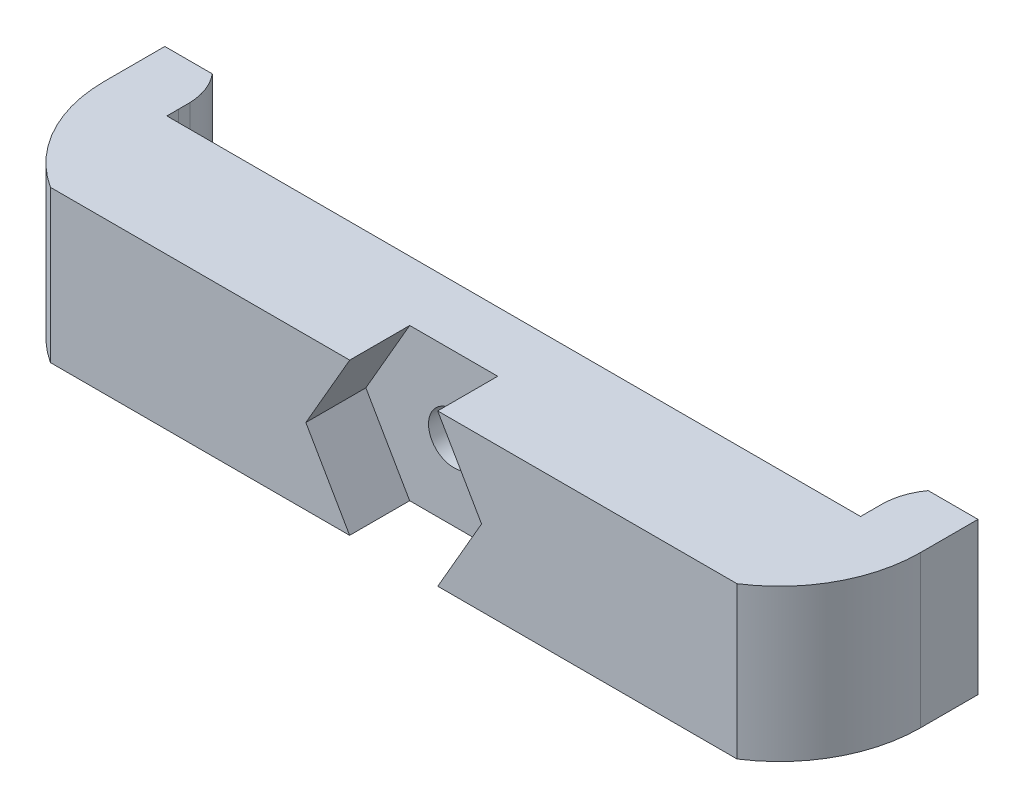
ISO-10303-21;
HEADER;
FILE_DESCRIPTION(('STEP AP214'),'2;1');
FILE_NAME('part.step','',(''),(''),'','','');
FILE_SCHEMA(('AUTOMOTIVE_DESIGN { 1 0 10303 214 1 1 1 1 }'));
ENDSEC;
DATA;
#1=APPLICATION_CONTEXT('core data for automotive mechanical design processes');
#2=APPLICATION_PROTOCOL_DEFINITION('international standard','automotive_design',2000,#1);
#3=PRODUCT_CONTEXT('',#1,'mechanical');
#4=PRODUCT('Part','Part','',(#3));
#5=PRODUCT_RELATED_PRODUCT_CATEGORY('part','',(#4));
#6=PRODUCT_DEFINITION_FORMATION('','',#4);
#7=PRODUCT_DEFINITION_CONTEXT('part definition',#1,'design');
#8=PRODUCT_DEFINITION('design','',#6,#7);
#9=PRODUCT_DEFINITION_SHAPE('','',#8);
#10=(LENGTH_UNIT() NAMED_UNIT(*) SI_UNIT(.MILLI.,.METRE.));
#11=(NAMED_UNIT(*) PLANE_ANGLE_UNIT() SI_UNIT($,.RADIAN.));
#12=(NAMED_UNIT(*) SI_UNIT($,.STERADIAN.) SOLID_ANGLE_UNIT());
#13=UNCERTAINTY_MEASURE_WITH_UNIT(LENGTH_MEASURE(1.E-05),#10,'distance_accuracy_value','');
#14=(GEOMETRIC_REPRESENTATION_CONTEXT(3) GLOBAL_UNCERTAINTY_ASSIGNED_CONTEXT((#13)) GLOBAL_UNIT_ASSIGNED_CONTEXT((#10,
#11,#12)) REPRESENTATION_CONTEXT('',''));
#15=CARTESIAN_POINT('',(0.,0.,0.));
#16=DIRECTION('',(0.,0.,1.));
#17=DIRECTION('',(1.,0.,0.));
#18=AXIS2_PLACEMENT_3D('',#15,#16,#17);
#19=CARTESIAN_POINT('',(33.9,12.65,-11.7503239912908));
#20=DIRECTION('',(0.,1.,0.));
#21=DIRECTION('',(0.,0.,1.));
#22=AXIS2_PLACEMENT_3D('',#19,#20,#21);
#23=CYLINDRICAL_SURFACE('',#22,5.);
#24=DIRECTION('',(0.,1.,0.));
#25=VECTOR('',#24,1.);
#26=CARTESIAN_POINT('',(29.8508515633177,12.65,-14.6836492268747));
#27=LINE('',#26,#25);
#28=CARTESIAN_POINT('',(29.8508515633177,0.,-14.6836492268747));
#29=VERTEX_POINT('',#28);
#30=CARTESIAN_POINT('',(29.8508515633177,12.65,-14.6836492268747));
#31=VERTEX_POINT('',#30);
#32=EDGE_CURVE('E214',#29,#31,#27,.T.);
#33=ORIENTED_EDGE('',*,*,#32,.F.);
#34=CARTESIAN_POINT('',(33.9,0.,-11.7503239912908));
#35=DIRECTION('',(0.,-1.,0.));
#36=DIRECTION('',(0.,0.,-1.));
#37=AXIS2_PLACEMENT_3D('',#34,#35,#36);
#38=CIRCLE('',#37,5.);
#39=CARTESIAN_POINT('',(28.9033546437585,0.,-11.9334501334711));
#40=VERTEX_POINT('',#39);
#41=EDGE_CURVE('E353',#40,#29,#38,.T.);
#42=ORIENTED_EDGE('',*,*,#41,.F.);
#43=DIRECTION('',(0.,1.,0.));
#44=VECTOR('',#43,1.);
#45=CARTESIAN_POINT('',(28.9033546437585,12.65,-11.9334501334711));
#46=LINE('',#45,#44);
#47=CARTESIAN_POINT('',(28.9033546437585,12.65,-11.9334501334711));
#48=VERTEX_POINT('',#47);
#49=EDGE_CURVE('E58',#48,#40,#46,.F.);
#50=ORIENTED_EDGE('',*,*,#49,.F.);
#51=CARTESIAN_POINT('',(33.9,12.65,-11.7503239912908));
#52=DIRECTION('',(0.,-1.,0.));
#53=DIRECTION('',(0.,0.,-1.));
#54=AXIS2_PLACEMENT_3D('',#51,#52,#53);
#55=CIRCLE('',#54,5.);
#56=EDGE_CURVE('E355',#31,#48,#55,.F.);
#57=ORIENTED_EDGE('',*,*,#56,.F.);
#58=EDGE_LOOP('',(#33,#42,#50,#57));
#59=FACE_BOUND('',#58,.T.);
#60=ADVANCED_FACE('F37',(#59),#23,.T.);
#61=CARTESIAN_POINT('',(-33.9,12.65,-11.7503239912908));
#62=DIRECTION('',(0.,-1.,0.));
#63=DIRECTION('',(0.,0.,-1.));
#64=AXIS2_PLACEMENT_3D('',#61,#62,#63);
#65=CYLINDRICAL_SURFACE('',#64,5.);
#66=DIRECTION('',(0.,-1.,0.));
#67=VECTOR('',#66,1.);
#68=CARTESIAN_POINT('',(-28.9033546437585,12.65,-11.9334501334709));
#69=LINE('',#68,#67);
#70=CARTESIAN_POINT('',(-28.9033546437585,0.,-11.9334501334709));
#71=VERTEX_POINT('',#70);
#72=CARTESIAN_POINT('',(-28.9033546437585,12.65,-11.9334501334709));
#73=VERTEX_POINT('',#72);
#74=EDGE_CURVE('E237',#71,#73,#69,.F.);
#75=ORIENTED_EDGE('',*,*,#74,.F.);
#76=CARTESIAN_POINT('',(-33.9,0.,-11.7503239912908));
#77=DIRECTION('',(0.,-1.,0.));
#78=DIRECTION('',(0.,0.,-1.));
#79=AXIS2_PLACEMENT_3D('',#76,#77,#78);
#80=CIRCLE('',#79,5.);
#81=CARTESIAN_POINT('',(-30.0417402182721,0.,-14.9305490551347));
#82=VERTEX_POINT('',#81);
#83=EDGE_CURVE('E350',#82,#71,#80,.T.);
#84=ORIENTED_EDGE('',*,*,#83,.F.);
#85=DIRECTION('',(0.,-1.,0.));
#86=VECTOR('',#85,1.);
#87=CARTESIAN_POINT('',(-30.0417402182721,12.65,-14.9305490551347));
#88=LINE('',#87,#86);
#89=CARTESIAN_POINT('',(-30.0417402182721,12.65,-14.9305490551347));
#90=VERTEX_POINT('',#89);
#91=EDGE_CURVE('E226',#90,#82,#88,.T.);
#92=ORIENTED_EDGE('',*,*,#91,.F.);
#93=CARTESIAN_POINT('',(-33.9,12.65,-11.7503239912908));
#94=DIRECTION('',(0.,-1.,0.));
#95=DIRECTION('',(0.,0.,-1.));
#96=AXIS2_PLACEMENT_3D('',#93,#94,#95);
#97=CIRCLE('',#96,5.);
#98=EDGE_CURVE('E345',#73,#90,#97,.F.);
#99=ORIENTED_EDGE('',*,*,#98,.F.);
#100=EDGE_LOOP('',(#75,#84,#92,#99));
#101=FACE_BOUND('',#100,.T.);
#102=ADVANCED_FACE('F374',(#101),#65,.T.);
#103=CARTESIAN_POINT('',(-28.6,12.65,0.));
#104=DIRECTION('',(0.,0.,-1.));
#105=DIRECTION('',(-1.,0.,0.));
#106=AXIS2_PLACEMENT_3D('',#103,#104,#105);
#107=PLANE('',#106);
#108=DIRECTION('',(1.,0.,0.));
#109=VECTOR('',#108,1.);
#110=CARTESIAN_POINT('',(-28.6,12.65,0.));
#111=LINE('',#110,#109);
#112=CARTESIAN_POINT('',(3.66537279602967,12.65,0.));
#113=VERTEX_POINT('',#112);
#114=CARTESIAN_POINT('',(28.6,12.65,0.));
#115=VERTEX_POINT('',#114);
#116=EDGE_CURVE('E280',#113,#115,#111,.T.);
#117=ORIENTED_EDGE('',*,*,#116,.F.);
#118=DIRECTION('',(-0.499999999999999,0.866025403784439,0.));
#119=VECTOR('',#118,1.);
#120=CARTESIAN_POINT('',(7.31999999999999,6.32,0.));
#121=LINE('',#120,#119);
#122=CARTESIAN_POINT('',(7.31999999999999,6.32,0.));
#123=VERTEX_POINT('',#122);
#124=EDGE_CURVE('E246',#123,#113,#121,.T.);
#125=ORIENTED_EDGE('',*,*,#124,.F.);
#126=DIRECTION('',(0.5,0.866025403784438,0.));
#127=VECTOR('',#126,1.);
#128=CARTESIAN_POINT('',(3.65999999999999,-0.0193059557020838,0.));
#129=LINE('',#128,#127);
#130=CARTESIAN_POINT('',(3.67114629872155,0.,0.));
#131=VERTEX_POINT('',#130);
#132=EDGE_CURVE('E254',#131,#123,#129,.T.);
#133=ORIENTED_EDGE('',*,*,#132,.F.);
#134=DIRECTION('',(1.,0.,0.));
#135=VECTOR('',#134,1.);
#136=CARTESIAN_POINT('',(-28.6,0.,0.));
#137=LINE('',#136,#135);
#138=CARTESIAN_POINT('',(28.6,0.,0.));
#139=VERTEX_POINT('',#138);
#140=EDGE_CURVE('E300',#131,#139,#137,.T.);
#141=ORIENTED_EDGE('',*,*,#140,.T.);
#142=DIRECTION('',(0.,-1.,0.));
#143=VECTOR('',#142,1.);
#144=CARTESIAN_POINT('',(28.6,12.65,0.));
#145=LINE('',#144,#143);
#146=EDGE_CURVE('E322',#115,#139,#145,.T.);
#147=ORIENTED_EDGE('',*,*,#146,.F.);
#148=EDGE_LOOP('',(#117,#125,#133,#141,#147));
#149=FACE_BOUND('',#148,.T.);
#150=ADVANCED_FACE('F408',(#149),#107,.F.);
#151=CARTESIAN_POINT('',(-34.,12.65,-17.2661332877055));
#152=DIRECTION('',(1.,0.,0.));
#153=DIRECTION('',(0.,0.,-1.));
#154=AXIS2_PLACEMENT_3D('',#151,#152,#153);
#155=PLANE('',#154);
#156=DIRECTION('',(0.,0.,1.));
#157=VECTOR('',#156,1.);
#158=CARTESIAN_POINT('',(-34.,12.65,-17.2661332877055));
#159=LINE('',#158,#157);
#160=CARTESIAN_POINT('',(-34.,12.65,-14.9305490551347));
#161=VERTEX_POINT('',#160);
#162=CARTESIAN_POINT('',(-34.,12.65,-9.89204316547453));
#163=VERTEX_POINT('',#162);
#164=EDGE_CURVE('E275',#161,#163,#159,.T.);
#165=ORIENTED_EDGE('',*,*,#164,.F.);
#166=DIRECTION('',(0.,-1.,0.));
#167=VECTOR('',#166,1.);
#168=CARTESIAN_POINT('',(-34.,12.65,-14.9305490551347));
#169=LINE('',#168,#167);
#170=CARTESIAN_POINT('',(-34.,0.,-14.9305490551347));
#171=VERTEX_POINT('',#170);
#172=EDGE_CURVE('E223',#161,#171,#169,.T.);
#173=ORIENTED_EDGE('',*,*,#172,.T.);
#174=DIRECTION('',(0.,0.,1.));
#175=VECTOR('',#174,1.);
#176=CARTESIAN_POINT('',(-34.,0.,-17.2661332877055));
#177=LINE('',#176,#175);
#178=CARTESIAN_POINT('',(-34.,0.,-9.89204316547453));
#179=VERTEX_POINT('',#178);
#180=EDGE_CURVE('E274',#171,#179,#177,.T.);
#181=ORIENTED_EDGE('',*,*,#180,.T.);
#182=DIRECTION('',(0.,-1.,0.));
#183=VECTOR('',#182,1.);
#184=CARTESIAN_POINT('',(-34.,12.65,-9.89204316547453));
#185=LINE('',#184,#183);
#186=EDGE_CURVE('E328',#163,#179,#185,.T.);
#187=ORIENTED_EDGE('',*,*,#186,.F.);
#188=EDGE_LOOP('',(#165,#173,#181,#187));
#189=FACE_BOUND('',#188,.T.);
#190=ADVANCED_FACE('F442',(#189),#155,.F.);
#191=CARTESIAN_POINT('',(-22.2395816678133,12.65,-9.8920431654748));
#192=DIRECTION('',(0.,-1.,0.));
#193=DIRECTION('',(0.,0.,-1.));
#194=AXIS2_PLACEMENT_3D('',#191,#192,#193);
#195=CYLINDRICAL_SURFACE('',#194,11.7604183321867);
#196=CARTESIAN_POINT('',(-22.2395816678133,0.,-9.8920431654748));
#197=DIRECTION('',(0.,1.,0.));
#198=DIRECTION('',(0.,0.,1.));
#199=AXIS2_PLACEMENT_3D('',#196,#197,#198);
#200=CIRCLE('',#199,11.7604183321867);
#201=CARTESIAN_POINT('',(-28.6,0.,0.));
#202=VERTEX_POINT('',#201);
#203=EDGE_CURVE('E298',#179,#202,#200,.T.);
#204=ORIENTED_EDGE('',*,*,#203,.T.);
#205=DIRECTION('',(0.,-1.,0.));
#206=VECTOR('',#205,1.);
#207=CARTESIAN_POINT('',(-28.6,12.65,0.));
#208=LINE('',#207,#206);
#209=CARTESIAN_POINT('',(-28.6,12.65,0.));
#210=VERTEX_POINT('',#209);
#211=EDGE_CURVE('E325',#210,#202,#208,.T.);
#212=ORIENTED_EDGE('',*,*,#211,.F.);
#213=CARTESIAN_POINT('',(-22.2395816678133,12.65,-9.8920431654748));
#214=DIRECTION('',(0.,1.,0.));
#215=DIRECTION('',(0.,0.,1.));
#216=AXIS2_PLACEMENT_3D('',#213,#214,#215);
#217=CIRCLE('',#216,11.7604183321867);
#218=EDGE_CURVE('E277',#163,#210,#217,.T.);
#219=ORIENTED_EDGE('',*,*,#218,.F.);
#220=ORIENTED_EDGE('',*,*,#186,.T.);
#221=EDGE_LOOP('',(#204,#212,#219,#220));
#222=FACE_BOUND('',#221,.T.);
#223=ADVANCED_FACE('F438',(#222),#195,.T.);
#224=CARTESIAN_POINT('',(-3.67114629872155,0.,0.));
#225=VERTEX_POINT('',#224);
#226=EDGE_CURVE('E301',#202,#225,#137,.T.);
#227=ORIENTED_EDGE('',*,*,#226,.T.);
#228=DIRECTION('',(0.5,-0.866025403784439,0.));
#229=VECTOR('',#228,1.);
#230=CARTESIAN_POINT('',(-7.31999999999999,6.32,0.));
#231=LINE('',#230,#229);
#232=CARTESIAN_POINT('',(-7.31999999999999,6.32,0.));
#233=VERTEX_POINT('',#232);
#234=EDGE_CURVE('E264',#233,#225,#231,.T.);
#235=ORIENTED_EDGE('',*,*,#234,.F.);
#236=DIRECTION('',(-0.5,-0.866025403784439,0.));
#237=VECTOR('',#236,1.);
#238=CARTESIAN_POINT('',(-3.65999999999999,12.6593059557021,0.));
#239=LINE('',#238,#237);
#240=CARTESIAN_POINT('',(-3.66537279602966,12.65,0.));
#241=VERTEX_POINT('',#240);
#242=EDGE_CURVE('E262',#241,#233,#239,.T.);
#243=ORIENTED_EDGE('',*,*,#242,.F.);
#244=EDGE_CURVE('E281',#210,#241,#111,.T.);
#245=ORIENTED_EDGE('',*,*,#244,.F.);
#246=ORIENTED_EDGE('',*,*,#211,.T.);
#247=EDGE_LOOP('',(#227,#235,#243,#245,#246));
#248=FACE_BOUND('',#247,.T.);
#249=ADVANCED_FACE('F428',(#248),#107,.F.);
#250=CARTESIAN_POINT('',(22.2395816678138,12.65,-9.89204316547453));
#251=DIRECTION('',(0.,-1.,0.));
#252=DIRECTION('',(0.,0.,-1.));
#253=AXIS2_PLACEMENT_3D('',#250,#251,#252);
#254=CYLINDRICAL_SURFACE('',#253,11.7604183321862);
#255=CARTESIAN_POINT('',(22.2395816678138,0.,-9.89204316547453));
#256=DIRECTION('',(0.,1.,0.));
#257=DIRECTION('',(0.,0.,-1.));
#258=AXIS2_PLACEMENT_3D('',#255,#256,#257);
#259=CIRCLE('',#258,11.7604183321862);
#260=CARTESIAN_POINT('',(34.,0.,-9.89204316547453));
#261=VERTEX_POINT('',#260);
#262=EDGE_CURVE('E304',#139,#261,#259,.T.);
#263=ORIENTED_EDGE('',*,*,#262,.T.);
#264=DIRECTION('',(0.,-1.,0.));
#265=VECTOR('',#264,1.);
#266=CARTESIAN_POINT('',(34.,12.65,-9.89204316547453));
#267=LINE('',#266,#265);
#268=CARTESIAN_POINT('',(34.,12.65,-9.89204316547453));
#269=VERTEX_POINT('',#268);
#270=EDGE_CURVE('E319',#269,#261,#267,.T.);
#271=ORIENTED_EDGE('',*,*,#270,.F.);
#272=CARTESIAN_POINT('',(22.2395816678138,12.65,-9.89204316547453));
#273=DIRECTION('',(0.,1.,0.));
#274=DIRECTION('',(0.,0.,-1.));
#275=AXIS2_PLACEMENT_3D('',#272,#273,#274);
#276=CIRCLE('',#275,11.7604183321862);
#277=EDGE_CURVE('E284',#115,#269,#276,.T.);
#278=ORIENTED_EDGE('',*,*,#277,.F.);
#279=ORIENTED_EDGE('',*,*,#146,.T.);
#280=EDGE_LOOP('',(#263,#271,#278,#279));
#281=FACE_BOUND('',#280,.T.);
#282=ADVANCED_FACE('F401',(#281),#254,.T.);
#283=CARTESIAN_POINT('',(34.,12.65,-17.2661332877055));
#284=DIRECTION('',(-1.,0.,0.));
#285=DIRECTION('',(0.,0.,1.));
#286=AXIS2_PLACEMENT_3D('',#283,#284,#285);
#287=PLANE('',#286);
#288=DIRECTION('',(0.,0.,-1.));
#289=VECTOR('',#288,1.);
#290=CARTESIAN_POINT('',(34.,0.,-17.2661332877055));
#291=LINE('',#290,#289);
#292=CARTESIAN_POINT('',(34.,0.,-14.6836492268747));
#293=VERTEX_POINT('',#292);
#294=EDGE_CURVE('E306',#261,#293,#291,.T.);
#295=ORIENTED_EDGE('',*,*,#294,.T.);
#296=DIRECTION('',(0.,1.,0.));
#297=VECTOR('',#296,1.);
#298=CARTESIAN_POINT('',(34.,12.65,-14.6836492268747));
#299=LINE('',#298,#297);
#300=CARTESIAN_POINT('',(34.,12.65,-14.6836492268747));
#301=VERTEX_POINT('',#300);
#302=EDGE_CURVE('E50',#293,#301,#299,.T.);
#303=ORIENTED_EDGE('',*,*,#302,.T.);
#304=DIRECTION('',(0.,0.,-1.));
#305=VECTOR('',#304,1.);
#306=CARTESIAN_POINT('',(34.,12.65,-17.2661332877055));
#307=LINE('',#306,#305);
#308=EDGE_CURVE('E286',#269,#301,#307,.T.);
#309=ORIENTED_EDGE('',*,*,#308,.F.);
#310=ORIENTED_EDGE('',*,*,#270,.T.);
#311=EDGE_LOOP('',(#295,#303,#309,#310));
#312=FACE_BOUND('',#311,.T.);
#313=ADVANCED_FACE('F396',(#312),#287,.F.);
#314=CARTESIAN_POINT('',(28.9,12.65,-15.));
#315=DIRECTION('',(1.,0.,0.));
#316=DIRECTION('',(0.,0.,-1.));
#317=AXIS2_PLACEMENT_3D('',#314,#315,#316);
#318=PLANE('',#317);
#319=DIRECTION('',(0.,0.,1.));
#320=VECTOR('',#319,1.);
#321=CARTESIAN_POINT('',(28.9,12.65,-15.));
#322=LINE('',#321,#320);
#323=CARTESIAN_POINT('',(28.9,12.65,-10.9506275499279));
#324=VERTEX_POINT('',#323);
#325=CARTESIAN_POINT('',(28.9,12.65,-10.));
#326=VERTEX_POINT('',#325);
#327=EDGE_CURVE('E289',#324,#326,#322,.T.);
#328=ORIENTED_EDGE('',*,*,#327,.F.);
#329=DIRECTION('',(0.,-1.,0.));
#330=VECTOR('',#329,1.);
#331=CARTESIAN_POINT('',(28.9,12.65,-10.9506275499279));
#332=LINE('',#331,#330);
#333=CARTESIAN_POINT('',(28.9,0.,-10.9506275499279));
#334=VERTEX_POINT('',#333);
#335=EDGE_CURVE('E208',#324,#334,#332,.T.);
#336=ORIENTED_EDGE('',*,*,#335,.T.);
#337=DIRECTION('',(0.,0.,1.));
#338=VECTOR('',#337,1.);
#339=CARTESIAN_POINT('',(28.9,0.,-15.));
#340=LINE('',#339,#338);
#341=CARTESIAN_POINT('',(28.9,0.,-10.));
#342=VERTEX_POINT('',#341);
#343=EDGE_CURVE('E202',#334,#342,#340,.T.);
#344=ORIENTED_EDGE('',*,*,#343,.T.);
#345=DIRECTION('',(0.,-1.,0.));
#346=VECTOR('',#345,1.);
#347=CARTESIAN_POINT('',(28.9,12.65,-10.));
#348=LINE('',#347,#346);
#349=EDGE_CURVE('E316',#326,#342,#348,.T.);
#350=ORIENTED_EDGE('',*,*,#349,.F.);
#351=EDGE_LOOP('',(#328,#336,#344,#350));
#352=FACE_BOUND('',#351,.T.);
#353=ADVANCED_FACE('F389',(#352),#318,.F.);
#354=CARTESIAN_POINT('',(28.9,12.65,-10.));
#355=DIRECTION('',(0.,0.,1.));
#356=DIRECTION('',(1.,0.,0.));
#357=AXIS2_PLACEMENT_3D('',#354,#355,#356);
#358=PLANE('',#357);
#359=CARTESIAN_POINT('',(0.,6.32,-10.));
#360=DIRECTION('',(0.,0.,-1.));
#361=DIRECTION('',(-1.,0.,0.));
#362=AXIS2_PLACEMENT_3D('',#359,#360,#361);
#363=CIRCLE('',#362,4.75);
#364=CARTESIAN_POINT('',(-4.75,6.32,-10.));
#365=VERTEX_POINT('',#364);
#366=EDGE_CURVE('E247',#365,#365,#363,.T.);
#367=ORIENTED_EDGE('',*,*,#366,.F.);
#368=EDGE_LOOP('',(#367));
#369=FACE_BOUND('',#368,.T.);
#370=DIRECTION('',(-1.,0.,0.));
#371=VECTOR('',#370,1.);
#372=CARTESIAN_POINT('',(28.9,0.,-10.));
#373=LINE('',#372,#371);
#374=CARTESIAN_POINT('',(-28.9,0.,-10.));
#375=VERTEX_POINT('',#374);
#376=EDGE_CURVE('E310',#342,#375,#373,.T.);
#377=ORIENTED_EDGE('',*,*,#376,.T.);
#378=DIRECTION('',(0.,-1.,0.));
#379=VECTOR('',#378,1.);
#380=CARTESIAN_POINT('',(-28.9,12.65,-10.));
#381=LINE('',#380,#379);
#382=CARTESIAN_POINT('',(-28.9,12.65,-10.));
#383=VERTEX_POINT('',#382);
#384=EDGE_CURVE('E296',#383,#375,#381,.T.);
#385=ORIENTED_EDGE('',*,*,#384,.F.);
#386=DIRECTION('',(-1.,0.,0.));
#387=VECTOR('',#386,1.);
#388=CARTESIAN_POINT('',(28.9,12.65,-10.));
#389=LINE('',#388,#387);
#390=EDGE_CURVE('E291',#326,#383,#389,.T.);
#391=ORIENTED_EDGE('',*,*,#390,.F.);
#392=ORIENTED_EDGE('',*,*,#349,.T.);
#393=EDGE_LOOP('',(#377,#385,#391,#392));
#394=FACE_BOUND('',#393,.T.);
#395=ADVANCED_FACE('F384',(#369,#394),#358,.F.);
#396=CARTESIAN_POINT('',(-28.9,12.65,-15.));
#397=DIRECTION('',(-1.,0.,0.));
#398=DIRECTION('',(0.,0.,1.));
#399=AXIS2_PLACEMENT_3D('',#396,#397,#398);
#400=PLANE('',#399);
#401=DIRECTION('',(0.,0.,-1.));
#402=VECTOR('',#401,1.);
#403=CARTESIAN_POINT('',(-28.9,0.,-15.));
#404=LINE('',#403,#402);
#405=CARTESIAN_POINT('',(-28.9,0.,-10.9534597171963));
#406=VERTEX_POINT('',#405);
#407=EDGE_CURVE('E278',#375,#406,#404,.T.);
#408=ORIENTED_EDGE('',*,*,#407,.T.);
#409=DIRECTION('',(0.,1.,0.));
#410=VECTOR('',#409,1.);
#411=CARTESIAN_POINT('',(-28.9,12.65,-10.9534597171963));
#412=LINE('',#411,#410);
#413=CARTESIAN_POINT('',(-28.9,12.65,-10.9534597171963));
#414=VERTEX_POINT('',#413);
#415=EDGE_CURVE('E231',#406,#414,#412,.T.);
#416=ORIENTED_EDGE('',*,*,#415,.T.);
#417=DIRECTION('',(0.,0.,-1.));
#418=VECTOR('',#417,1.);
#419=CARTESIAN_POINT('',(-28.9,12.65,-15.));
#420=LINE('',#419,#418);
#421=EDGE_CURVE('E293',#383,#414,#420,.T.);
#422=ORIENTED_EDGE('',*,*,#421,.F.);
#423=ORIENTED_EDGE('',*,*,#384,.T.);
#424=EDGE_LOOP('',(#408,#416,#422,#423));
#425=FACE_BOUND('',#424,.T.);
#426=ADVANCED_FACE('F381',(#425),#400,.F.);
#427=CARTESIAN_POINT('',(22.2395816678138,12.65,-9.89204316547453));
#428=DIRECTION('',(0.,-1.,0.));
#429=DIRECTION('',(0.,0.,-1.));
#430=AXIS2_PLACEMENT_3D('',#427,#428,#429);
#431=PLANE('',#430);
#432=ORIENTED_EDGE('',*,*,#308,.T.);
#433=DIRECTION('',(-1.,0.,0.));
#434=VECTOR('',#433,1.);
#435=CARTESIAN_POINT('',(22.2395816678138,12.65,-14.6836492268747));
#436=LINE('',#435,#434);
#437=EDGE_CURVE('E210',#301,#31,#436,.T.);
#438=ORIENTED_EDGE('',*,*,#437,.T.);
#439=ORIENTED_EDGE('',*,*,#56,.T.);
#440=DIRECTION('',(0.,0.,1.));
#441=VECTOR('',#440,1.);
#442=CARTESIAN_POINT('',(28.9033546437585,12.65,-9.89204316547453));
#443=LINE('',#442,#441);
#444=CARTESIAN_POINT('',(28.9033546437585,12.65,-10.9422367085318));
#445=VERTEX_POINT('',#444);
#446=EDGE_CURVE('E192',#48,#445,#443,.T.);
#447=ORIENTED_EDGE('',*,*,#446,.T.);
#448=DIRECTION('',(-0.37122918158221,0.,-0.928541272503168));
#449=VECTOR('',#448,1.);
#450=CARTESIAN_POINT('',(28.347016136848,12.65,-12.3337848162193));
#451=LINE('',#450,#449);
#452=EDGE_CURVE('E190',#445,#324,#451,.T.);
#453=ORIENTED_EDGE('',*,*,#452,.T.);
#454=ORIENTED_EDGE('',*,*,#327,.T.);
#455=ORIENTED_EDGE('',*,*,#390,.T.);
#456=ORIENTED_EDGE('',*,*,#421,.T.);
#457=DIRECTION('',(-0.28638760967903,0.,0.958113843456158));
#458=VECTOR('',#457,1.);
#459=CARTESIAN_POINT('',(-24.9968849378332,12.65,-24.011386971296));
#460=LINE('',#459,#458);
#461=CARTESIAN_POINT('',(-28.9033546437585,12.65,-10.9422367085318));
#462=VERTEX_POINT('',#461);
#463=EDGE_CURVE('E228',#414,#462,#460,.T.);
#464=ORIENTED_EDGE('',*,*,#463,.T.);
#465=DIRECTION('',(0.,0.,-1.));
#466=VECTOR('',#465,1.);
#467=CARTESIAN_POINT('',(-28.9033546437585,12.65,-9.89204316547453));
#468=LINE('',#467,#466);
#469=EDGE_CURVE('E234',#462,#73,#468,.T.);
#470=ORIENTED_EDGE('',*,*,#469,.T.);
#471=ORIENTED_EDGE('',*,*,#98,.T.);
#472=DIRECTION('',(-1.,0.,0.));
#473=VECTOR('',#472,1.);
#474=CARTESIAN_POINT('',(22.2395816678138,12.65,-14.9305490551347));
#475=LINE('',#474,#473);
#476=EDGE_CURVE('E220',#90,#161,#475,.T.);
#477=ORIENTED_EDGE('',*,*,#476,.T.);
#478=ORIENTED_EDGE('',*,*,#164,.T.);
#479=ORIENTED_EDGE('',*,*,#218,.T.);
#480=ORIENTED_EDGE('',*,*,#244,.T.);
#481=DIRECTION('',(0.,0.,-1.));
#482=VECTOR('',#481,1.);
#483=CARTESIAN_POINT('',(-3.66537279602966,12.65,-9.89204316547453));
#484=LINE('',#483,#482);
#485=CARTESIAN_POINT('',(-3.66537279602966,12.65,-5.));
#486=VERTEX_POINT('',#485);
#487=EDGE_CURVE('E339',#241,#486,#484,.T.);
#488=ORIENTED_EDGE('',*,*,#487,.T.);
#489=DIRECTION('',(-1.,0.,0.));
#490=VECTOR('',#489,1.);
#491=CARTESIAN_POINT('',(22.2395816678138,12.65,-5.));
#492=LINE('',#491,#490);
#493=CARTESIAN_POINT('',(3.66537279602967,12.65,-5.));
#494=VERTEX_POINT('',#493);
#495=EDGE_CURVE('E270',#494,#486,#492,.T.);
#496=ORIENTED_EDGE('',*,*,#495,.F.);
#497=DIRECTION('',(0.,0.,1.));
#498=VECTOR('',#497,1.);
#499=CARTESIAN_POINT('',(3.66537279602967,12.65,-9.89204316547453));
#500=LINE('',#499,#498);
#501=EDGE_CURVE('E342',#494,#113,#500,.T.);
#502=ORIENTED_EDGE('',*,*,#501,.T.);
#503=ORIENTED_EDGE('',*,*,#116,.T.);
#504=ORIENTED_EDGE('',*,*,#277,.T.);
#505=EDGE_LOOP('',(#432,#438,#439,#447,#453,#454,#455,#456,#464,#470,#471,#477,#478,#479,#480,
#488,#496,#502,#503,#504));
#506=FACE_BOUND('',#505,.T.);
#507=ADVANCED_FACE('F377',(#506),#431,.F.);
#508=CARTESIAN_POINT('',(22.2395816678138,0.,-9.89204316547453));
#509=DIRECTION('',(0.,-1.,0.));
#510=DIRECTION('',(0.,0.,-1.));
#511=AXIS2_PLACEMENT_3D('',#508,#509,#510);
#512=PLANE('',#511);
#513=DIRECTION('',(-1.,0.,0.));
#514=VECTOR('',#513,1.);
#515=CARTESIAN_POINT('',(22.2395816678138,0.,-14.6836492268747));
#516=LINE('',#515,#514);
#517=EDGE_CURVE('E11',#293,#29,#516,.T.);
#518=ORIENTED_EDGE('',*,*,#517,.F.);
#519=ORIENTED_EDGE('',*,*,#294,.F.);
#520=ORIENTED_EDGE('',*,*,#262,.F.);
#521=ORIENTED_EDGE('',*,*,#140,.F.);
#522=DIRECTION('',(0.,0.,1.));
#523=VECTOR('',#522,1.);
#524=CARTESIAN_POINT('',(3.67114629872155,0.,-9.89204316547453));
#525=LINE('',#524,#523);
#526=CARTESIAN_POINT('',(3.67114629872155,0.,-5.));
#527=VERTEX_POINT('',#526);
#528=EDGE_CURVE('E337',#527,#131,#525,.T.);
#529=ORIENTED_EDGE('',*,*,#528,.F.);
#530=DIRECTION('',(-1.,0.,0.));
#531=VECTOR('',#530,1.);
#532=CARTESIAN_POINT('',(22.2395816678138,0.,-5.));
#533=LINE('',#532,#531);
#534=CARTESIAN_POINT('',(-3.67114629872155,0.,-5.));
#535=VERTEX_POINT('',#534);
#536=EDGE_CURVE('E331',#527,#535,#533,.T.);
#537=ORIENTED_EDGE('',*,*,#536,.T.);
#538=DIRECTION('',(0.,0.,-1.));
#539=VECTOR('',#538,1.);
#540=CARTESIAN_POINT('',(-3.67114629872155,0.,-9.89204316547453));
#541=LINE('',#540,#539);
#542=EDGE_CURVE('E334',#225,#535,#541,.T.);
#543=ORIENTED_EDGE('',*,*,#542,.F.);
#544=ORIENTED_EDGE('',*,*,#226,.F.);
#545=ORIENTED_EDGE('',*,*,#203,.F.);
#546=ORIENTED_EDGE('',*,*,#180,.F.);
#547=DIRECTION('',(-1.,0.,0.));
#548=VECTOR('',#547,1.);
#549=CARTESIAN_POINT('',(22.2395816678138,0.,-14.9305490551347));
#550=LINE('',#549,#548);
#551=EDGE_CURVE('E358',#82,#171,#550,.T.);
#552=ORIENTED_EDGE('',*,*,#551,.F.);
#553=ORIENTED_EDGE('',*,*,#83,.T.);
#554=DIRECTION('',(0.,0.,-1.));
#555=VECTOR('',#554,1.);
#556=CARTESIAN_POINT('',(-28.9033546437585,0.,-10.9422367085318));
#557=LINE('',#556,#555);
#558=CARTESIAN_POINT('',(-28.9033546437585,0.,-10.9422367085318));
#559=VERTEX_POINT('',#558);
#560=EDGE_CURVE('E216',#559,#71,#557,.T.);
#561=ORIENTED_EDGE('',*,*,#560,.F.);
#562=DIRECTION('',(-0.28638760967903,0.,0.958113843456158));
#563=VECTOR('',#562,1.);
#564=CARTESIAN_POINT('',(-24.9968849378332,0.,-24.011386971296));
#565=LINE('',#564,#563);
#566=EDGE_CURVE('E198',#406,#559,#565,.T.);
#567=ORIENTED_EDGE('',*,*,#566,.F.);
#568=ORIENTED_EDGE('',*,*,#407,.F.);
#569=ORIENTED_EDGE('',*,*,#376,.F.);
#570=ORIENTED_EDGE('',*,*,#343,.F.);
#571=DIRECTION('',(-0.37122918158221,0.,-0.928541272503168));
#572=VECTOR('',#571,1.);
#573=CARTESIAN_POINT('',(28.9033546437585,0.,-10.9422367085318));
#574=LINE('',#573,#572);
#575=CARTESIAN_POINT('',(28.9033546437585,0.,-10.9422367085318));
#576=VERTEX_POINT('',#575);
#577=EDGE_CURVE('E187',#576,#334,#574,.T.);
#578=ORIENTED_EDGE('',*,*,#577,.F.);
#579=DIRECTION('',(0.,0.,1.));
#580=VECTOR('',#579,1.);
#581=CARTESIAN_POINT('',(28.9033546437585,0.,-9.89204316547453));
#582=LINE('',#581,#580);
#583=EDGE_CURVE('E44',#40,#576,#582,.T.);
#584=ORIENTED_EDGE('',*,*,#583,.F.);
#585=ORIENTED_EDGE('',*,*,#41,.T.);
#586=EDGE_LOOP('',(#518,#519,#520,#521,#529,#537,#543,#544,#545,#546,#552,#553,#561,#567,#568,
#569,#570,#578,#584,#585));
#587=FACE_BOUND('',#586,.T.);
#588=ADVANCED_FACE('F200',(#587),#512,.T.);
#589=CARTESIAN_POINT('',(7.31999999999999,6.32,-5.));
#590=DIRECTION('',(0.866025403784439,0.499999999999999,0.));
#591=DIRECTION('',(-0.499999999999999,0.866025403784439,0.));
#592=AXIS2_PLACEMENT_3D('',#589,#590,#591);
#593=PLANE('',#592);
#594=DIRECTION('',(-0.499999999999999,0.866025403784439,0.));
#595=VECTOR('',#594,1.);
#596=CARTESIAN_POINT('',(7.31999999999999,6.32,-5.));
#597=LINE('',#596,#595);
#598=CARTESIAN_POINT('',(7.31999999999999,6.32,-5.));
#599=VERTEX_POINT('',#598);
#600=EDGE_CURVE('E250',#599,#494,#597,.T.);
#601=ORIENTED_EDGE('',*,*,#600,.F.);
#602=DIRECTION('',(0.,0.,1.));
#603=VECTOR('',#602,1.);
#604=CARTESIAN_POINT('',(7.31999999999999,6.32,-5.));
#605=LINE('',#604,#603);
#606=EDGE_CURVE('E267',#599,#123,#605,.T.);
#607=ORIENTED_EDGE('',*,*,#606,.T.);
#608=ORIENTED_EDGE('',*,*,#124,.T.);
#609=ORIENTED_EDGE('',*,*,#501,.F.);
#610=EDGE_LOOP('',(#601,#607,#608,#609));
#611=FACE_BOUND('',#610,.T.);
#612=ADVANCED_FACE('F416',(#611),#593,.F.);
#613=CARTESIAN_POINT('',(-3.65999999999999,12.6593059557021,-5.));
#614=DIRECTION('',(-0.866025403784438,0.5,0.));
#615=DIRECTION('',(-0.5,-0.866025403784439,0.));
#616=AXIS2_PLACEMENT_3D('',#613,#614,#615);
#617=PLANE('',#616);
#618=ORIENTED_EDGE('',*,*,#242,.T.);
#619=DIRECTION('',(0.,0.,1.));
#620=VECTOR('',#619,1.);
#621=CARTESIAN_POINT('',(-7.31999999999999,6.32,-5.));
#622=LINE('',#621,#620);
#623=CARTESIAN_POINT('',(-7.31999999999999,6.32,-5.));
#624=VERTEX_POINT('',#623);
#625=EDGE_CURVE('E260',#624,#233,#622,.T.);
#626=ORIENTED_EDGE('',*,*,#625,.F.);
#627=DIRECTION('',(-0.5,-0.866025403784439,0.));
#628=VECTOR('',#627,1.);
#629=CARTESIAN_POINT('',(-3.65999999999999,12.6593059557021,-5.));
#630=LINE('',#629,#628);
#631=EDGE_CURVE('E253',#486,#624,#630,.T.);
#632=ORIENTED_EDGE('',*,*,#631,.F.);
#633=ORIENTED_EDGE('',*,*,#487,.F.);
#634=EDGE_LOOP('',(#618,#626,#632,#633));
#635=FACE_BOUND('',#634,.T.);
#636=ADVANCED_FACE('F424',(#635),#617,.F.);
#637=CARTESIAN_POINT('',(0.,0.,-5.));
#638=DIRECTION('',(0.,0.,1.));
#639=DIRECTION('',(1.,0.,0.));
#640=AXIS2_PLACEMENT_3D('',#637,#638,#639);
#641=PLANE('',#640);
#642=CARTESIAN_POINT('',(0.,6.32,-5.));
#643=DIRECTION('',(0.,0.,1.));
#644=DIRECTION('',(1.,0.,0.));
#645=AXIS2_PLACEMENT_3D('',#642,#643,#644);
#646=CIRCLE('',#645,2.1);
#647=CARTESIAN_POINT('',(2.1,6.32,-5.));
#648=VERTEX_POINT('',#647);
#649=EDGE_CURVE('E239',#648,#648,#646,.T.);
#650=ORIENTED_EDGE('',*,*,#649,.F.);
#651=EDGE_LOOP('',(#650));
#652=FACE_BOUND('',#651,.T.);
#653=ORIENTED_EDGE('',*,*,#495,.T.);
#654=ORIENTED_EDGE('',*,*,#631,.T.);
#655=DIRECTION('',(0.5,-0.866025403784439,0.));
#656=VECTOR('',#655,1.);
#657=CARTESIAN_POINT('',(-7.31999999999999,6.32,-5.));
#658=LINE('',#657,#656);
#659=EDGE_CURVE('E256',#624,#535,#658,.T.);
#660=ORIENTED_EDGE('',*,*,#659,.T.);
#661=ORIENTED_EDGE('',*,*,#536,.F.);
#662=DIRECTION('',(0.5,0.866025403784438,0.));
#663=VECTOR('',#662,1.);
#664=CARTESIAN_POINT('',(3.65999999999999,-0.0193059557020838,-5.));
#665=LINE('',#664,#663);
#666=EDGE_CURVE('E258',#527,#599,#665,.T.);
#667=ORIENTED_EDGE('',*,*,#666,.T.);
#668=ORIENTED_EDGE('',*,*,#600,.T.);
#669=EDGE_LOOP('',(#653,#654,#660,#661,#667,#668));
#670=FACE_BOUND('',#669,.T.);
#671=ADVANCED_FACE('F419',(#652,#670),#641,.T.);
#672=CARTESIAN_POINT('',(3.65999999999999,-0.0193059557020838,-5.));
#673=DIRECTION('',(0.866025403784438,-0.5,0.));
#674=DIRECTION('',(0.5,0.866025403784439,0.));
#675=AXIS2_PLACEMENT_3D('',#672,#673,#674);
#676=PLANE('',#675);
#677=ORIENTED_EDGE('',*,*,#528,.T.);
#678=ORIENTED_EDGE('',*,*,#132,.T.);
#679=ORIENTED_EDGE('',*,*,#606,.F.);
#680=ORIENTED_EDGE('',*,*,#666,.F.);
#681=EDGE_LOOP('',(#677,#678,#679,#680));
#682=FACE_BOUND('',#681,.T.);
#683=ADVANCED_FACE('F412',(#682),#676,.F.);
#684=CARTESIAN_POINT('',(-7.31999999999999,6.32,-5.));
#685=DIRECTION('',(-0.866025403784439,-0.5,0.));
#686=DIRECTION('',(0.5,-0.866025403784439,0.));
#687=AXIS2_PLACEMENT_3D('',#684,#685,#686);
#688=PLANE('',#687);
#689=ORIENTED_EDGE('',*,*,#542,.T.);
#690=ORIENTED_EDGE('',*,*,#659,.F.);
#691=ORIENTED_EDGE('',*,*,#625,.T.);
#692=ORIENTED_EDGE('',*,*,#234,.T.);
#693=EDGE_LOOP('',(#689,#690,#691,#692));
#694=FACE_BOUND('',#693,.T.);
#695=ADVANCED_FACE('F432',(#694),#688,.F.);
#696=CARTESIAN_POINT('',(0.,6.32,-7.));
#697=DIRECTION('',(0.,0.,-1.));
#698=DIRECTION('',(-1.,0.,0.));
#699=AXIS2_PLACEMENT_3D('',#696,#697,#698);
#700=CYLINDRICAL_SURFACE('',#699,4.75);
#701=CARTESIAN_POINT('',(0.,6.32,-7.));
#702=DIRECTION('',(0.,0.,-1.));
#703=DIRECTION('',(-1.,0.,0.));
#704=AXIS2_PLACEMENT_3D('',#701,#702,#703);
#705=CIRCLE('',#704,4.75);
#706=CARTESIAN_POINT('',(-4.75,6.32,-7.));
#707=VERTEX_POINT('',#706);
#708=EDGE_CURVE('E243',#707,#707,#705,.T.);
#709=ORIENTED_EDGE('',*,*,#708,.F.);
#710=EDGE_LOOP('',(#709));
#711=FACE_BOUND('',#710,.T.);
#712=ORIENTED_EDGE('',*,*,#366,.T.);
#713=EDGE_LOOP('',(#712));
#714=FACE_BOUND('',#713,.T.);
#715=ADVANCED_FACE('F492',(#711,#714),#700,.F.);
#716=CARTESIAN_POINT('',(0.,6.32,-7.));
#717=DIRECTION('',(0.,0.,-1.));
#718=DIRECTION('',(-1.,0.,0.));
#719=AXIS2_PLACEMENT_3D('',#716,#717,#718);
#720=PLANE('',#719);
#721=CARTESIAN_POINT('',(0.,6.32,-7.));
#722=DIRECTION('',(0.,0.,-1.));
#723=DIRECTION('',(-1.,0.,0.));
#724=AXIS2_PLACEMENT_3D('',#721,#722,#723);
#725=CIRCLE('',#724,2.1);
#726=CARTESIAN_POINT('',(-2.1,6.32,-7.));
#727=VERTEX_POINT('',#726);
#728=EDGE_CURVE('E242',#727,#727,#725,.T.);
#729=ORIENTED_EDGE('',*,*,#728,.F.);
#730=EDGE_LOOP('',(#729));
#731=FACE_BOUND('',#730,.T.);
#732=ORIENTED_EDGE('',*,*,#708,.T.);
#733=EDGE_LOOP('',(#732));
#734=FACE_BOUND('',#733,.T.);
#735=ADVANCED_FACE('F453',(#731,#734),#720,.T.);
#736=CARTESIAN_POINT('',(0.,6.32,-15.));
#737=DIRECTION('',(0.,0.,1.));
#738=DIRECTION('',(1.,0.,0.));
#739=AXIS2_PLACEMENT_3D('',#736,#737,#738);
#740=CYLINDRICAL_SURFACE('',#739,2.1);
#741=ORIENTED_EDGE('',*,*,#728,.T.);
#742=EDGE_LOOP('',(#741));
#743=FACE_BOUND('',#742,.T.);
#744=ORIENTED_EDGE('',*,*,#649,.T.);
#745=EDGE_LOOP('',(#744));
#746=FACE_BOUND('',#745,.T.);
#747=ADVANCED_FACE('F446',(#743,#746),#740,.F.);
#748=CARTESIAN_POINT('',(-32.1764960351877,15.,-14.9305490551347));
#749=DIRECTION('',(0.,0.,1.));
#750=DIRECTION('',(1.,0.,0.));
#751=AXIS2_PLACEMENT_3D('',#748,#749,#750);
#752=PLANE('',#751);
#753=ORIENTED_EDGE('',*,*,#91,.T.);
#754=ORIENTED_EDGE('',*,*,#551,.T.);
#755=ORIENTED_EDGE('',*,*,#172,.F.);
#756=ORIENTED_EDGE('',*,*,#476,.F.);
#757=EDGE_LOOP('',(#753,#754,#755,#756));
#758=FACE_BOUND('',#757,.T.);
#759=ADVANCED_FACE('F444',(#758),#752,.F.);
#760=CARTESIAN_POINT('',(-28.9033546437585,15.,-10.9422367085318));
#761=DIRECTION('',(0.958113843456158,0.,0.28638760967903));
#762=DIRECTION('',(0.28638760967903,0.,-0.958113843456158));
#763=AXIS2_PLACEMENT_3D('',#760,#761,#762);
#764=PLANE('',#763);
#765=ORIENTED_EDGE('',*,*,#566,.T.);
#766=DIRECTION('',(0.,-1.,0.));
#767=VECTOR('',#766,1.);
#768=CARTESIAN_POINT('',(-28.9033546437585,15.,-10.9422367085318));
#769=LINE('',#768,#767);
#770=EDGE_CURVE('E218',#462,#559,#769,.T.);
#771=ORIENTED_EDGE('',*,*,#770,.F.);
#772=ORIENTED_EDGE('',*,*,#463,.F.);
#773=ORIENTED_EDGE('',*,*,#415,.F.);
#774=EDGE_LOOP('',(#765,#771,#772,#773));
#775=FACE_BOUND('',#774,.T.);
#776=ADVANCED_FACE('F365',(#775),#764,.F.);
#777=CARTESIAN_POINT('',(-28.9033546437585,15.,-10.9422367085318));
#778=DIRECTION('',(-1.,0.,0.));
#779=DIRECTION('',(0.,0.,1.));
#780=AXIS2_PLACEMENT_3D('',#777,#778,#779);
#781=PLANE('',#780);
#782=ORIENTED_EDGE('',*,*,#74,.T.);
#783=ORIENTED_EDGE('',*,*,#469,.F.);
#784=ORIENTED_EDGE('',*,*,#770,.T.);
#785=ORIENTED_EDGE('',*,*,#560,.T.);
#786=EDGE_LOOP('',(#782,#783,#784,#785));
#787=FACE_BOUND('',#786,.T.);
#788=ADVANCED_FACE('F371',(#787),#781,.F.);
#789=CARTESIAN_POINT('',(28.9033546437585,15.,-10.9422367085318));
#790=DIRECTION('',(1.,0.,0.));
#791=DIRECTION('',(0.,0.,-1.));
#792=AXIS2_PLACEMENT_3D('',#789,#790,#791);
#793=PLANE('',#792);
#794=ORIENTED_EDGE('',*,*,#49,.T.);
#795=ORIENTED_EDGE('',*,*,#583,.T.);
#796=DIRECTION('',(0.,-1.,0.));
#797=VECTOR('',#796,1.);
#798=CARTESIAN_POINT('',(28.9033546437585,15.,-10.9422367085318));
#799=LINE('',#798,#797);
#800=EDGE_CURVE('E184',#445,#576,#799,.T.);
#801=ORIENTED_EDGE('',*,*,#800,.F.);
#802=ORIENTED_EDGE('',*,*,#446,.F.);
#803=EDGE_LOOP('',(#794,#795,#801,#802));
#804=FACE_BOUND('',#803,.T.);
#805=ADVANCED_FACE('F194',(#804),#793,.F.);
#806=CARTESIAN_POINT('',(28.9033546437585,15.,-10.9422367085318));
#807=DIRECTION('',(-0.928541272503168,0.,0.37122918158221));
#808=DIRECTION('',(0.37122918158221,0.,0.928541272503168));
#809=AXIS2_PLACEMENT_3D('',#806,#807,#808);
#810=PLANE('',#809);
#811=ORIENTED_EDGE('',*,*,#452,.F.);
#812=ORIENTED_EDGE('',*,*,#800,.T.);
#813=ORIENTED_EDGE('',*,*,#577,.T.);
#814=ORIENTED_EDGE('',*,*,#335,.F.);
#815=EDGE_LOOP('',(#811,#812,#813,#814));
#816=FACE_BOUND('',#815,.T.);
#817=ADVANCED_FACE('F185',(#816),#810,.F.);
#818=CARTESIAN_POINT('',(31.9980351056839,15.,-14.6836492268747));
#819=DIRECTION('',(0.,0.,1.));
#820=DIRECTION('',(1.,0.,0.));
#821=AXIS2_PLACEMENT_3D('',#818,#819,#820);
#822=PLANE('',#821);
#823=ORIENTED_EDGE('',*,*,#32,.T.);
#824=ORIENTED_EDGE('',*,*,#437,.F.);
#825=ORIENTED_EDGE('',*,*,#302,.F.);
#826=ORIENTED_EDGE('',*,*,#517,.T.);
#827=EDGE_LOOP('',(#823,#824,#825,#826));
#828=FACE_BOUND('',#827,.T.);
#829=ADVANCED_FACE('F511',(#828),#822,.F.);
#830=CLOSED_SHELL('',(#60,#102,#150,#190,#223,#249,#282,#313,#353,#395,#426,#507,#588,#612,#636,
#671,#683,#695,#715,#735,#747,#759,#776,#788,#805,#817,#829));
#831=MANIFOLD_SOLID_BREP('B2',#830);
#832=ADVANCED_BREP_SHAPE_REPRESENTATION('',(#18,#831),#14);
#833=SHAPE_DEFINITION_REPRESENTATION(#9,#832);
ENDSEC;
END-ISO-10303-21;
